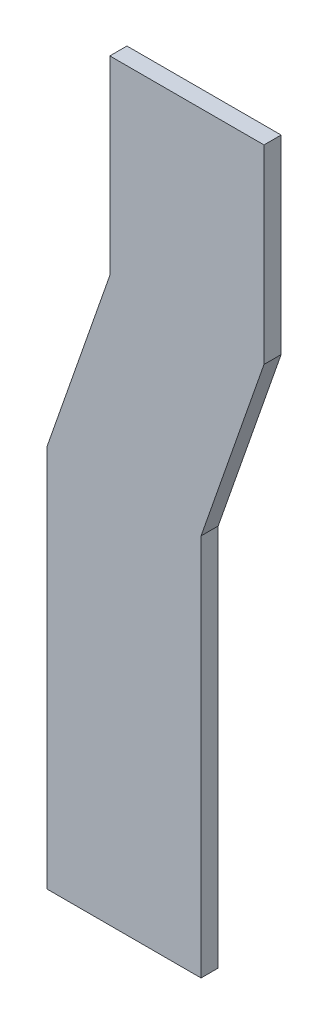
ISO-10303-21;
HEADER;
FILE_DESCRIPTION(('STEP AP214'),'2;1');
FILE_NAME('part.step','',(''),(''),'','','');
FILE_SCHEMA(('AUTOMOTIVE_DESIGN { 1 0 10303 214 1 1 1 1 }'));
ENDSEC;
DATA;
#1=APPLICATION_CONTEXT('core data for automotive mechanical design processes');
#2=APPLICATION_PROTOCOL_DEFINITION('international standard','automotive_design',2000,#1);
#3=PRODUCT_CONTEXT('',#1,'mechanical');
#4=PRODUCT('Part','Part','',(#3));
#5=PRODUCT_RELATED_PRODUCT_CATEGORY('part','',(#4));
#6=PRODUCT_DEFINITION_FORMATION('','',#4);
#7=PRODUCT_DEFINITION_CONTEXT('part definition',#1,'design');
#8=PRODUCT_DEFINITION('design','',#6,#7);
#9=PRODUCT_DEFINITION_SHAPE('','',#8);
#10=(LENGTH_UNIT() NAMED_UNIT(*) SI_UNIT(.MILLI.,.METRE.));
#11=(NAMED_UNIT(*) PLANE_ANGLE_UNIT() SI_UNIT($,.RADIAN.));
#12=(NAMED_UNIT(*) SI_UNIT($,.STERADIAN.) SOLID_ANGLE_UNIT());
#13=UNCERTAINTY_MEASURE_WITH_UNIT(LENGTH_MEASURE(1.E-05),#10,'distance_accuracy_value','');
#14=(GEOMETRIC_REPRESENTATION_CONTEXT(3) GLOBAL_UNCERTAINTY_ASSIGNED_CONTEXT((#13)) GLOBAL_UNIT_ASSIGNED_CONTEXT((#10,
#11,#12)) REPRESENTATION_CONTEXT('',''));
#15=CARTESIAN_POINT('',(0.,0.,0.));
#16=DIRECTION('',(0.,0.,1.));
#17=DIRECTION('',(1.,0.,0.));
#18=AXIS2_PLACEMENT_3D('',#15,#16,#17);
#19=CARTESIAN_POINT('',(0.,0.,10.));
#20=DIRECTION('',(1.,0.,0.));
#21=DIRECTION('',(0.,1.,0.));
#22=AXIS2_PLACEMENT_3D('',#19,#20,#21);
#23=PLANE('',#22);
#24=DIRECTION('',(0.,-1.,0.));
#25=VECTOR('',#24,1.);
#26=CARTESIAN_POINT('',(0.,0.,-10.));
#27=LINE('',#26,#25);
#28=CARTESIAN_POINT('',(0.,0.,-10.));
#29=VERTEX_POINT('',#28);
#30=CARTESIAN_POINT('',(0.,-222.,-10.));
#31=VERTEX_POINT('',#30);
#32=EDGE_CURVE('E139',#29,#31,#27,.T.);
#33=ORIENTED_EDGE('',*,*,#32,.T.);
#34=DIRECTION('',(0.,0.,-1.));
#35=VECTOR('',#34,1.);
#36=CARTESIAN_POINT('',(0.,-222.,10.));
#37=LINE('',#36,#35);
#38=CARTESIAN_POINT('',(0.,-222.,10.));
#39=VERTEX_POINT('',#38);
#40=EDGE_CURVE('E11',#39,#31,#37,.T.);
#41=ORIENTED_EDGE('',*,*,#40,.F.);
#42=DIRECTION('',(0.,-1.,0.));
#43=VECTOR('',#42,1.);
#44=CARTESIAN_POINT('',(0.,0.,10.));
#45=LINE('',#44,#43);
#46=CARTESIAN_POINT('',(0.,0.,10.));
#47=VERTEX_POINT('',#46);
#48=EDGE_CURVE('E153',#47,#39,#45,.T.);
#49=ORIENTED_EDGE('',*,*,#48,.F.);
#50=DIRECTION('',(0.,0.,-1.));
#51=VECTOR('',#50,1.);
#52=CARTESIAN_POINT('',(0.,0.,10.));
#53=LINE('',#52,#51);
#54=EDGE_CURVE('E135',#47,#29,#53,.T.);
#55=ORIENTED_EDGE('',*,*,#54,.T.);
#56=EDGE_LOOP('',(#33,#41,#49,#55));
#57=FACE_BOUND('',#56,.T.);
#58=ADVANCED_FACE('F43',(#57),#23,.F.);
#59=CARTESIAN_POINT('',(0.,-222.,10.));
#60=DIRECTION('',(0.943916265368806,-0.330184923902054,0.));
#61=DIRECTION('',(0.330184923902054,0.943916265368806,0.));
#62=AXIS2_PLACEMENT_3D('',#59,#60,#61);
#63=PLANE('',#62);
#64=DIRECTION('',(-0.330184923902054,-0.943916265368806,0.));
#65=VECTOR('',#64,1.);
#66=CARTESIAN_POINT('',(0.,-222.,-10.));
#67=LINE('',#66,#65);
#68=CARTESIAN_POINT('',(-73.4859566636412,-432.078004020481,-10.));
#69=VERTEX_POINT('',#68);
#70=EDGE_CURVE('E142',#31,#69,#67,.T.);
#71=ORIENTED_EDGE('',*,*,#70,.T.);
#72=DIRECTION('',(0.,0.,-1.));
#73=VECTOR('',#72,1.);
#74=CARTESIAN_POINT('',(-73.4859566636412,-432.078004020481,10.));
#75=LINE('',#74,#73);
#76=CARTESIAN_POINT('',(-73.4859566636412,-432.078004020481,10.));
#77=VERTEX_POINT('',#76);
#78=EDGE_CURVE('E51',#77,#69,#75,.T.);
#79=ORIENTED_EDGE('',*,*,#78,.F.);
#80=DIRECTION('',(-0.330184923902054,-0.943916265368806,0.));
#81=VECTOR('',#80,1.);
#82=CARTESIAN_POINT('',(0.,-222.,10.));
#83=LINE('',#82,#81);
#84=EDGE_CURVE('E102',#39,#77,#83,.T.);
#85=ORIENTED_EDGE('',*,*,#84,.F.);
#86=ORIENTED_EDGE('',*,*,#40,.T.);
#87=EDGE_LOOP('',(#71,#79,#85,#86));
#88=FACE_BOUND('',#87,.T.);
#89=ADVANCED_FACE('F188',(#88),#63,.F.);
#90=CARTESIAN_POINT('',(-73.4859566636412,-432.078004020481,10.));
#91=DIRECTION('',(1.,0.,0.));
#92=DIRECTION('',(0.,1.,0.));
#93=AXIS2_PLACEMENT_3D('',#90,#91,#92);
#94=PLANE('',#93);
#95=DIRECTION('',(0.,-1.,0.));
#96=VECTOR('',#95,1.);
#97=CARTESIAN_POINT('',(-73.4859566636412,-432.078004020481,-10.));
#98=LINE('',#97,#96);
#99=CARTESIAN_POINT('',(-73.4859566636411,-879.078004020482,-10.));
#100=VERTEX_POINT('',#99);
#101=EDGE_CURVE('E144',#69,#100,#98,.T.);
#102=ORIENTED_EDGE('',*,*,#101,.T.);
#103=DIRECTION('',(0.,0.,-1.));
#104=VECTOR('',#103,1.);
#105=CARTESIAN_POINT('',(-73.4859566636411,-879.078004020482,10.));
#106=LINE('',#105,#104);
#107=CARTESIAN_POINT('',(-73.4859566636411,-879.078004020482,10.));
#108=VERTEX_POINT('',#107);
#109=EDGE_CURVE('E160',#108,#100,#106,.T.);
#110=ORIENTED_EDGE('',*,*,#109,.F.);
#111=DIRECTION('',(0.,-1.,0.));
#112=VECTOR('',#111,1.);
#113=CARTESIAN_POINT('',(-73.4859566636412,-432.078004020481,10.));
#114=LINE('',#113,#112);
#115=EDGE_CURVE('E168',#77,#108,#114,.T.);
#116=ORIENTED_EDGE('',*,*,#115,.F.);
#117=ORIENTED_EDGE('',*,*,#78,.T.);
#118=EDGE_LOOP('',(#102,#110,#116,#117));
#119=FACE_BOUND('',#118,.T.);
#120=ADVANCED_FACE('F166',(#119),#94,.F.);
#121=CARTESIAN_POINT('',(106.514043336359,-879.078004020482,10.));
#122=DIRECTION('',(0.,1.,0.));
#123=DIRECTION('',(0.,0.,1.));
#124=AXIS2_PLACEMENT_3D('',#121,#122,#123);
#125=PLANE('',#124);
#126=DIRECTION('',(1.,0.,0.));
#127=VECTOR('',#126,1.);
#128=CARTESIAN_POINT('',(106.514043336359,-879.078004020482,-10.));
#129=LINE('',#128,#127);
#130=CARTESIAN_POINT('',(106.514043336359,-879.078004020482,-10.));
#131=VERTEX_POINT('',#130);
#132=EDGE_CURVE('E146',#100,#131,#129,.T.);
#133=ORIENTED_EDGE('',*,*,#132,.T.);
#134=DIRECTION('',(0.,0.,-1.));
#135=VECTOR('',#134,1.);
#136=CARTESIAN_POINT('',(106.514043336359,-879.078004020482,10.));
#137=LINE('',#136,#135);
#138=CARTESIAN_POINT('',(106.514043336359,-879.078004020482,10.));
#139=VERTEX_POINT('',#138);
#140=EDGE_CURVE('E157',#139,#131,#137,.T.);
#141=ORIENTED_EDGE('',*,*,#140,.F.);
#142=DIRECTION('',(1.,0.,0.));
#143=VECTOR('',#142,1.);
#144=CARTESIAN_POINT('',(106.514043336359,-879.078004020482,10.));
#145=LINE('',#144,#143);
#146=EDGE_CURVE('E180',#108,#139,#145,.T.);
#147=ORIENTED_EDGE('',*,*,#146,.F.);
#148=ORIENTED_EDGE('',*,*,#109,.T.);
#149=EDGE_LOOP('',(#133,#141,#147,#148));
#150=FACE_BOUND('',#149,.T.);
#151=ADVANCED_FACE('F176',(#150),#125,.F.);
#152=CARTESIAN_POINT('',(106.514043336359,-432.078004020481,10.));
#153=DIRECTION('',(-1.,0.,0.));
#154=DIRECTION('',(0.,-1.,0.));
#155=AXIS2_PLACEMENT_3D('',#152,#153,#154);
#156=PLANE('',#155);
#157=DIRECTION('',(0.,1.,0.));
#158=VECTOR('',#157,1.);
#159=CARTESIAN_POINT('',(106.514043336359,-432.078004020481,-10.));
#160=LINE('',#159,#158);
#161=CARTESIAN_POINT('',(106.514043336359,-432.078004020481,-10.));
#162=VERTEX_POINT('',#161);
#163=EDGE_CURVE('E148',#131,#162,#160,.T.);
#164=ORIENTED_EDGE('',*,*,#163,.T.);
#165=DIRECTION('',(0.,0.,-1.));
#166=VECTOR('',#165,1.);
#167=CARTESIAN_POINT('',(106.514043336359,-432.078004020481,10.));
#168=LINE('',#167,#166);
#169=CARTESIAN_POINT('',(106.514043336359,-432.078004020481,10.));
#170=VERTEX_POINT('',#169);
#171=EDGE_CURVE('E130',#170,#162,#168,.T.);
#172=ORIENTED_EDGE('',*,*,#171,.F.);
#173=DIRECTION('',(0.,1.,0.));
#174=VECTOR('',#173,1.);
#175=CARTESIAN_POINT('',(106.514043336359,-432.078004020481,10.));
#176=LINE('',#175,#174);
#177=EDGE_CURVE('E121',#139,#170,#176,.T.);
#178=ORIENTED_EDGE('',*,*,#177,.F.);
#179=ORIENTED_EDGE('',*,*,#140,.T.);
#180=EDGE_LOOP('',(#164,#172,#178,#179));
#181=FACE_BOUND('',#180,.T.);
#182=ADVANCED_FACE('F179',(#181),#156,.F.);
#183=CARTESIAN_POINT('',(180.,-222.,10.));
#184=DIRECTION('',(-0.943916265368806,0.330184923902054,0.));
#185=DIRECTION('',(-0.330184923902054,-0.943916265368806,0.));
#186=AXIS2_PLACEMENT_3D('',#183,#184,#185);
#187=PLANE('',#186);
#188=DIRECTION('',(0.330184923902054,0.943916265368806,0.));
#189=VECTOR('',#188,1.);
#190=CARTESIAN_POINT('',(180.,-222.,-10.));
#191=LINE('',#190,#189);
#192=CARTESIAN_POINT('',(180.,-222.,-10.));
#193=VERTEX_POINT('',#192);
#194=EDGE_CURVE('E129',#162,#193,#191,.T.);
#195=ORIENTED_EDGE('',*,*,#194,.T.);
#196=DIRECTION('',(0.,0.,-1.));
#197=VECTOR('',#196,1.);
#198=CARTESIAN_POINT('',(180.,-222.,10.));
#199=LINE('',#198,#197);
#200=CARTESIAN_POINT('',(180.,-222.,10.));
#201=VERTEX_POINT('',#200);
#202=EDGE_CURVE('E126',#201,#193,#199,.T.);
#203=ORIENTED_EDGE('',*,*,#202,.F.);
#204=DIRECTION('',(0.330184923902054,0.943916265368806,0.));
#205=VECTOR('',#204,1.);
#206=CARTESIAN_POINT('',(180.,-222.,10.));
#207=LINE('',#206,#205);
#208=EDGE_CURVE('E115',#170,#201,#207,.T.);
#209=ORIENTED_EDGE('',*,*,#208,.F.);
#210=ORIENTED_EDGE('',*,*,#171,.T.);
#211=EDGE_LOOP('',(#195,#203,#209,#210));
#212=FACE_BOUND('',#211,.T.);
#213=ADVANCED_FACE('F127',(#212),#187,.F.);
#214=CARTESIAN_POINT('',(180.,0.,10.));
#215=DIRECTION('',(-1.,0.,0.));
#216=DIRECTION('',(0.,-1.,0.));
#217=AXIS2_PLACEMENT_3D('',#214,#215,#216);
#218=PLANE('',#217);
#219=DIRECTION('',(0.,1.,0.));
#220=VECTOR('',#219,1.);
#221=CARTESIAN_POINT('',(180.,0.,-10.));
#222=LINE('',#221,#220);
#223=CARTESIAN_POINT('',(180.,0.,-10.));
#224=VERTEX_POINT('',#223);
#225=EDGE_CURVE('E88',#193,#224,#222,.T.);
#226=ORIENTED_EDGE('',*,*,#225,.T.);
#227=DIRECTION('',(0.,0.,-1.));
#228=VECTOR('',#227,1.);
#229=CARTESIAN_POINT('',(180.,0.,10.));
#230=LINE('',#229,#228);
#231=CARTESIAN_POINT('',(180.,0.,10.));
#232=VERTEX_POINT('',#231);
#233=EDGE_CURVE('E131',#232,#224,#230,.T.);
#234=ORIENTED_EDGE('',*,*,#233,.F.);
#235=DIRECTION('',(0.,1.,0.));
#236=VECTOR('',#235,1.);
#237=CARTESIAN_POINT('',(180.,0.,10.));
#238=LINE('',#237,#236);
#239=EDGE_CURVE('E119',#201,#232,#238,.T.);
#240=ORIENTED_EDGE('',*,*,#239,.F.);
#241=ORIENTED_EDGE('',*,*,#202,.T.);
#242=EDGE_LOOP('',(#226,#234,#240,#241));
#243=FACE_BOUND('',#242,.T.);
#244=ADVANCED_FACE('F133',(#243),#218,.F.);
#245=CARTESIAN_POINT('',(0.,0.,10.));
#246=DIRECTION('',(0.,-1.,0.));
#247=DIRECTION('',(0.,0.,-1.));
#248=AXIS2_PLACEMENT_3D('',#245,#246,#247);
#249=PLANE('',#248);
#250=DIRECTION('',(-1.,0.,0.));
#251=VECTOR('',#250,1.);
#252=CARTESIAN_POINT('',(0.,0.,-10.));
#253=LINE('',#252,#251);
#254=EDGE_CURVE('E94',#224,#29,#253,.T.);
#255=ORIENTED_EDGE('',*,*,#254,.T.);
#256=ORIENTED_EDGE('',*,*,#54,.F.);
#257=DIRECTION('',(-1.,0.,0.));
#258=VECTOR('',#257,1.);
#259=CARTESIAN_POINT('',(0.,0.,10.));
#260=LINE('',#259,#258);
#261=EDGE_CURVE('E59',#232,#47,#260,.T.);
#262=ORIENTED_EDGE('',*,*,#261,.F.);
#263=ORIENTED_EDGE('',*,*,#233,.T.);
#264=EDGE_LOOP('',(#255,#256,#262,#263));
#265=FACE_BOUND('',#264,.T.);
#266=ADVANCED_FACE('F204',(#265),#249,.F.);
#267=CARTESIAN_POINT('',(0.,0.,10.));
#268=DIRECTION('',(0.,0.,-1.));
#269=DIRECTION('',(-1.,0.,0.));
#270=AXIS2_PLACEMENT_3D('',#267,#268,#269);
#271=PLANE('',#270);
#272=ORIENTED_EDGE('',*,*,#48,.T.);
#273=ORIENTED_EDGE('',*,*,#84,.T.);
#274=ORIENTED_EDGE('',*,*,#115,.T.);
#275=ORIENTED_EDGE('',*,*,#146,.T.);
#276=ORIENTED_EDGE('',*,*,#177,.T.);
#277=ORIENTED_EDGE('',*,*,#208,.T.);
#278=ORIENTED_EDGE('',*,*,#239,.T.);
#279=ORIENTED_EDGE('',*,*,#261,.T.);
#280=EDGE_LOOP('',(#272,#273,#274,#275,#276,#277,#278,#279));
#281=FACE_BOUND('',#280,.T.);
#282=ADVANCED_FACE('F117',(#281),#271,.F.);
#283=CARTESIAN_POINT('',(0.,0.,-10.));
#284=DIRECTION('',(0.,0.,-1.));
#285=DIRECTION('',(-1.,0.,0.));
#286=AXIS2_PLACEMENT_3D('',#283,#284,#285);
#287=PLANE('',#286);
#288=ORIENTED_EDGE('',*,*,#32,.F.);
#289=ORIENTED_EDGE('',*,*,#254,.F.);
#290=ORIENTED_EDGE('',*,*,#225,.F.);
#291=ORIENTED_EDGE('',*,*,#194,.F.);
#292=ORIENTED_EDGE('',*,*,#163,.F.);
#293=ORIENTED_EDGE('',*,*,#132,.F.);
#294=ORIENTED_EDGE('',*,*,#101,.F.);
#295=ORIENTED_EDGE('',*,*,#70,.F.);
#296=EDGE_LOOP('',(#288,#289,#290,#291,#292,#293,#294,#295));
#297=FACE_BOUND('',#296,.T.);
#298=ADVANCED_FACE('F172',(#297),#287,.T.);
#299=CLOSED_SHELL('',(#58,#89,#120,#151,#182,#213,#244,#266,#282,#298));
#300=MANIFOLD_SOLID_BREP('B2',#299);
#301=ADVANCED_BREP_SHAPE_REPRESENTATION('',(#18,#300),#14);
#302=SHAPE_DEFINITION_REPRESENTATION(#9,#301);
ENDSEC;
END-ISO-10303-21;
